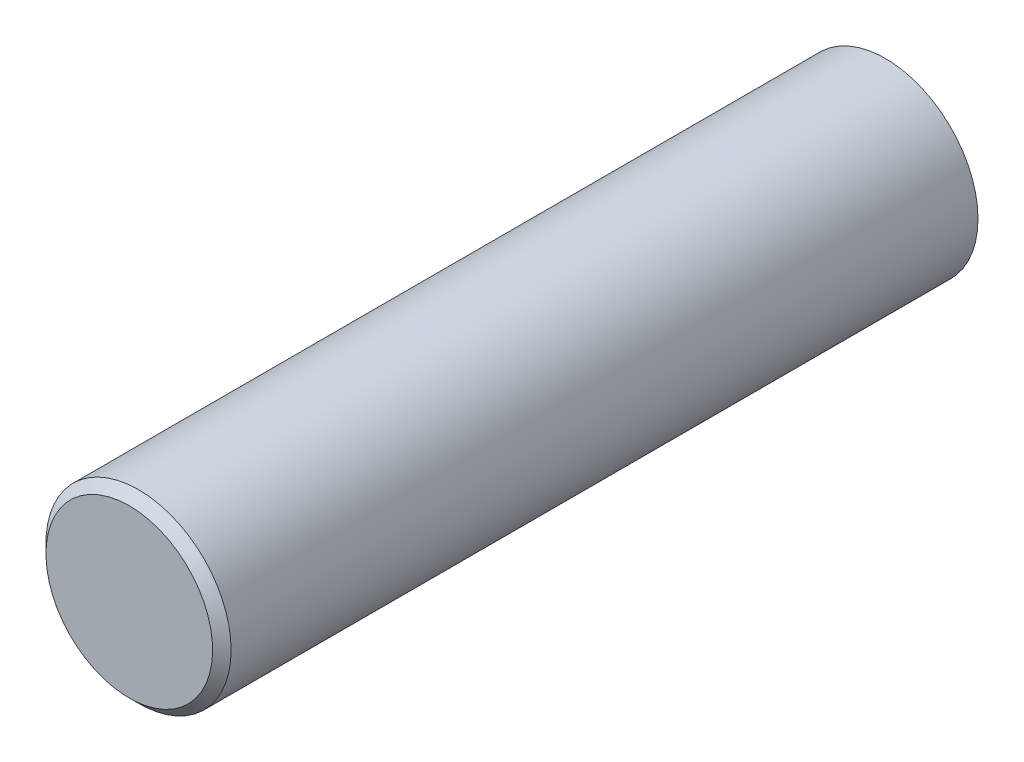
ISO-10303-21;
HEADER;
FILE_DESCRIPTION(('STEP AP214'),'2;1');
FILE_NAME('part.step','',(''),(''),'','','');
FILE_SCHEMA(('AUTOMOTIVE_DESIGN { 1 0 10303 214 1 1 1 1 }'));
ENDSEC;
DATA;
#1=APPLICATION_CONTEXT('core data for automotive mechanical design processes');
#2=APPLICATION_PROTOCOL_DEFINITION('international standard','automotive_design',2000,#1);
#3=PRODUCT_CONTEXT('',#1,'mechanical');
#4=PRODUCT('Part','Part','',(#3));
#5=PRODUCT_RELATED_PRODUCT_CATEGORY('part','',(#4));
#6=PRODUCT_DEFINITION_FORMATION('','',#4);
#7=PRODUCT_DEFINITION_CONTEXT('part definition',#1,'design');
#8=PRODUCT_DEFINITION('design','',#6,#7);
#9=PRODUCT_DEFINITION_SHAPE('','',#8);
#10=(LENGTH_UNIT() NAMED_UNIT(*) SI_UNIT(.MILLI.,.METRE.));
#11=(NAMED_UNIT(*) PLANE_ANGLE_UNIT() SI_UNIT($,.RADIAN.));
#12=(NAMED_UNIT(*) SI_UNIT($,.STERADIAN.) SOLID_ANGLE_UNIT());
#13=UNCERTAINTY_MEASURE_WITH_UNIT(LENGTH_MEASURE(1.E-05),#10,'distance_accuracy_value','');
#14=(GEOMETRIC_REPRESENTATION_CONTEXT(3) GLOBAL_UNCERTAINTY_ASSIGNED_CONTEXT((#13)) GLOBAL_UNIT_ASSIGNED_CONTEXT((#10,
#11,#12)) REPRESENTATION_CONTEXT('',''));
#15=CARTESIAN_POINT('',(0.,0.,0.));
#16=DIRECTION('',(0.,0.,1.));
#17=DIRECTION('',(1.,0.,0.));
#18=AXIS2_PLACEMENT_3D('',#15,#16,#17);
#19=CARTESIAN_POINT('',(0.,0.,201.5875));
#20=DIRECTION('',(0.,0.,1.));
#21=DIRECTION('',(1.,0.,0.));
#22=AXIS2_PLACEMENT_3D('',#19,#20,#21);
#23=PLANE('',#22);
#24=CARTESIAN_POINT('',(0.,0.,201.5875));
#25=DIRECTION('',(0.,0.,1.));
#26=DIRECTION('',(1.,0.,0.));
#27=AXIS2_PLACEMENT_3D('',#24,#25,#26);
#28=CIRCLE('',#27,28.73);
#29=CARTESIAN_POINT('',(28.73,0.,201.5875));
#30=VERTEX_POINT('',#29);
#31=EDGE_CURVE('E17',#30,#30,#28,.F.);
#32=ORIENTED_EDGE('',*,*,#31,.T.);
#33=EDGE_LOOP('',(#32));
#34=FACE_BOUND('',#33,.T.);
#35=ADVANCED_FACE('F14',(#34),#23,.F.);
#36=CARTESIAN_POINT('',(0.,0.,0.));
#37=DIRECTION('',(0.,0.,1.));
#38=DIRECTION('',(1.,0.,0.));
#39=AXIS2_PLACEMENT_3D('',#36,#37,#38);
#40=CYLINDRICAL_SURFACE('',#39,28.73);
#41=CARTESIAN_POINT('',(0.,0.,0.));
#42=DIRECTION('',(0.,0.,1.));
#43=DIRECTION('',(1.,0.,0.));
#44=AXIS2_PLACEMENT_3D('',#41,#42,#43);
#45=CIRCLE('',#44,28.73);
#46=CARTESIAN_POINT('',(28.73,0.,0.));
#47=VERTEX_POINT('',#46);
#48=EDGE_CURVE('E30',#47,#47,#45,.F.);
#49=ORIENTED_EDGE('',*,*,#48,.T.);
#50=EDGE_LOOP('',(#49));
#51=FACE_BOUND('',#50,.T.);
#52=ORIENTED_EDGE('',*,*,#31,.F.);
#53=EDGE_LOOP('',(#52));
#54=FACE_BOUND('',#53,.T.);
#55=ADVANCED_FACE('F38',(#51,#54),#40,.F.);
#56=CARTESIAN_POINT('',(0.,27.,245.));
#57=DIRECTION('',(0.,0.,-1.));
#58=DIRECTION('',(-1.,0.,0.));
#59=AXIS2_PLACEMENT_3D('',#56,#57,#58);
#60=PLANE('',#59);
#61=CARTESIAN_POINT('',(0.,0.,245.));
#62=DIRECTION('',(0.,0.,-1.));
#63=DIRECTION('',(0.,1.,0.));
#64=AXIS2_PLACEMENT_3D('',#61,#62,#63);
#65=CIRCLE('',#64,27.);
#66=CARTESIAN_POINT('',(0.,27.,245.));
#67=VERTEX_POINT('',#66);
#68=EDGE_CURVE('E26',#67,#67,#65,.T.);
#69=ORIENTED_EDGE('',*,*,#68,.F.);
#70=EDGE_LOOP('',(#69));
#71=FACE_BOUND('',#70,.T.);
#72=ADVANCED_FACE('F40',(#71),#60,.F.);
#73=CARTESIAN_POINT('',(0.,28.73,0.));
#74=DIRECTION('',(0.,0.,1.));
#75=DIRECTION('',(1.,0.,0.));
#76=AXIS2_PLACEMENT_3D('',#73,#74,#75);
#77=PLANE('',#76);
#78=ORIENTED_EDGE('',*,*,#48,.F.);
#79=EDGE_LOOP('',(#78));
#80=FACE_BOUND('',#79,.T.);
#81=CARTESIAN_POINT('',(0.,0.,0.));
#82=DIRECTION('',(0.,0.,1.));
#83=DIRECTION('',(1.,0.,0.));
#84=AXIS2_PLACEMENT_3D('',#81,#82,#83);
#85=CIRCLE('',#84,30.);
#86=CARTESIAN_POINT('',(30.,0.,0.));
#87=VERTEX_POINT('',#86);
#88=EDGE_CURVE('E21',#87,#87,#85,.T.);
#89=ORIENTED_EDGE('',*,*,#88,.F.);
#90=EDGE_LOOP('',(#89));
#91=FACE_BOUND('',#90,.T.);
#92=ADVANCED_FACE('F46',(#80,#91),#77,.F.);
#93=CARTESIAN_POINT('',(0.,0.,242.));
#94=DIRECTION('',(0.,0.,-1.));
#95=DIRECTION('',(0.,1.,0.));
#96=AXIS2_PLACEMENT_3D('',#93,#94,#95);
#97=CONICAL_SURFACE('',#96,30.,0.78539816339745);
#98=CARTESIAN_POINT('',(0.,0.,242.));
#99=DIRECTION('',(0.,0.,1.));
#100=DIRECTION('',(1.,0.,0.));
#101=AXIS2_PLACEMENT_3D('',#98,#99,#100);
#102=CIRCLE('',#101,30.);
#103=CARTESIAN_POINT('',(30.,0.,242.));
#104=VERTEX_POINT('',#103);
#105=EDGE_CURVE('E10',#104,#104,#102,.F.);
#106=ORIENTED_EDGE('',*,*,#105,.F.);
#107=EDGE_LOOP('',(#106));
#108=FACE_BOUND('',#107,.T.);
#109=ORIENTED_EDGE('',*,*,#68,.T.);
#110=EDGE_LOOP('',(#109));
#111=FACE_BOUND('',#110,.T.);
#112=ADVANCED_FACE('F52',(#108,#111),#97,.T.);
#113=CARTESIAN_POINT('',(0.,0.,0.));
#114=DIRECTION('',(0.,0.,1.));
#115=DIRECTION('',(1.,0.,0.));
#116=AXIS2_PLACEMENT_3D('',#113,#114,#115);
#117=CYLINDRICAL_SURFACE('',#116,30.);
#118=ORIENTED_EDGE('',*,*,#105,.T.);
#119=EDGE_LOOP('',(#118));
#120=FACE_BOUND('',#119,.T.);
#121=ORIENTED_EDGE('',*,*,#88,.T.);
#122=EDGE_LOOP('',(#121));
#123=FACE_BOUND('',#122,.T.);
#124=ADVANCED_FACE('F50',(#120,#123),#117,.T.);
#125=CLOSED_SHELL('',(#35,#55,#72,#92,#112,#124));
#126=MANIFOLD_SOLID_BREP('B1',#125);
#127=ADVANCED_BREP_SHAPE_REPRESENTATION('',(#18,#126),#14);
#128=SHAPE_DEFINITION_REPRESENTATION(#9,#127);
ENDSEC;
END-ISO-10303-21;
